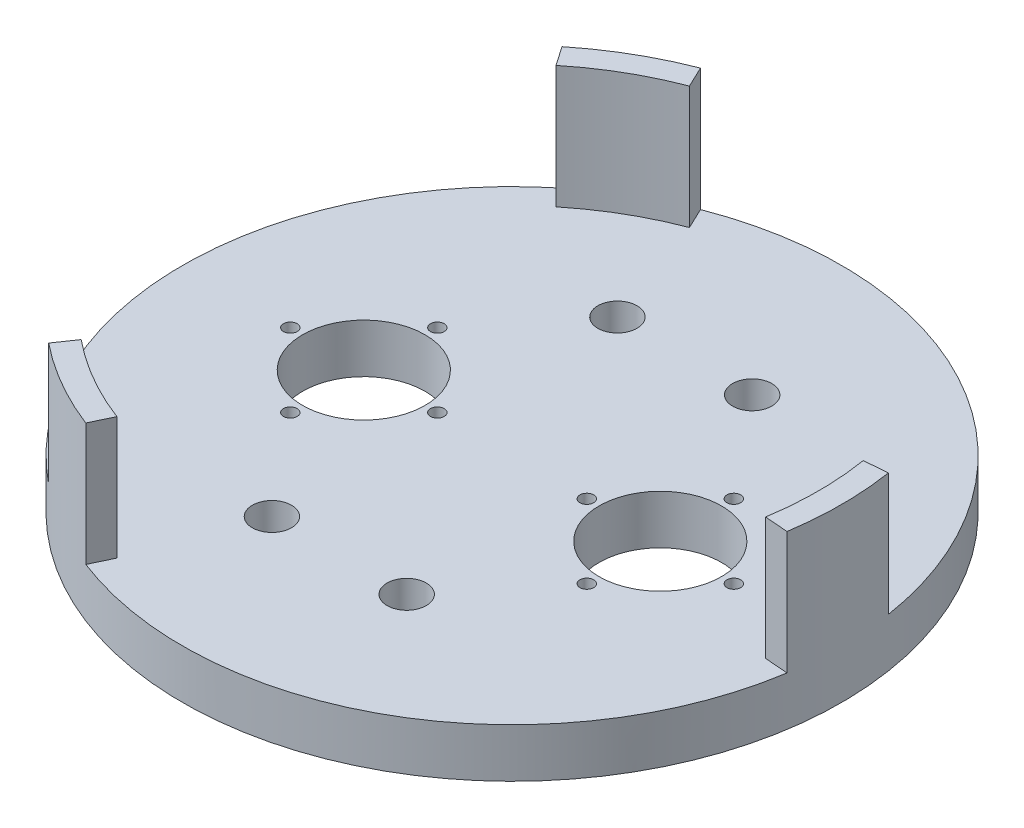
ISO-10303-21;
HEADER;
FILE_DESCRIPTION(('STEP AP214'),'2;1');
FILE_NAME('part.step','',(''),(''),'','','');
FILE_SCHEMA(('AUTOMOTIVE_DESIGN { 1 0 10303 214 1 1 1 1 }'));
ENDSEC;
DATA;
#1=APPLICATION_CONTEXT('core data for automotive mechanical design processes');
#2=APPLICATION_PROTOCOL_DEFINITION('international standard','automotive_design',2000,#1);
#3=PRODUCT_CONTEXT('',#1,'mechanical');
#4=PRODUCT('Part','Part','',(#3));
#5=PRODUCT_RELATED_PRODUCT_CATEGORY('part','',(#4));
#6=PRODUCT_DEFINITION_FORMATION('','',#4);
#7=PRODUCT_DEFINITION_CONTEXT('part definition',#1,'design');
#8=PRODUCT_DEFINITION('design','',#6,#7);
#9=PRODUCT_DEFINITION_SHAPE('','',#8);
#10=(LENGTH_UNIT() NAMED_UNIT(*) SI_UNIT(.MILLI.,.METRE.));
#11=(NAMED_UNIT(*) PLANE_ANGLE_UNIT() SI_UNIT($,.RADIAN.));
#12=(NAMED_UNIT(*) SI_UNIT($,.STERADIAN.) SOLID_ANGLE_UNIT());
#13=UNCERTAINTY_MEASURE_WITH_UNIT(LENGTH_MEASURE(1.E-05),#10,'distance_accuracy_value','');
#14=(GEOMETRIC_REPRESENTATION_CONTEXT(3) GLOBAL_UNCERTAINTY_ASSIGNED_CONTEXT((#13)) GLOBAL_UNIT_ASSIGNED_CONTEXT((#10,
#11,#12)) REPRESENTATION_CONTEXT('',''));
#15=CARTESIAN_POINT('',(0.,0.,0.));
#16=DIRECTION('',(0.,0.,1.));
#17=DIRECTION('',(1.,0.,0.));
#18=AXIS2_PLACEMENT_3D('',#15,#16,#17);
#19=CARTESIAN_POINT('',(63.8175,-154.94,-63.8175));
#20=DIRECTION('',(0.,1.,0.));
#21=DIRECTION('',(0.,0.,1.));
#22=AXIS2_PLACEMENT_3D('',#19,#20,#21);
#23=CYLINDRICAL_SURFACE('',#22,85.4075);
#24=CARTESIAN_POINT('',(63.8175,0.,-63.8175));
#25=DIRECTION('',(0.,-1.,0.));
#26=DIRECTION('',(0.,0.,-1.));
#27=AXIS2_PLACEMENT_3D('',#24,#25,#26);
#28=CIRCLE('',#27,85.4075);
#29=CARTESIAN_POINT('',(63.8175,0.,-149.225));
#30=VERTEX_POINT('',#29);
#31=EDGE_CURVE('E12',#30,#30,#28,.T.);
#32=ORIENTED_EDGE('',*,*,#31,.F.);
#33=EDGE_LOOP('',(#32));
#34=FACE_BOUND('',#33,.T.);
#35=CARTESIAN_POINT('',(63.8175,12.7,-63.8175));
#36=DIRECTION('',(0.,1.,0.));
#37=DIRECTION('',(0.,0.,1.));
#38=AXIS2_PLACEMENT_3D('',#35,#36,#37);
#39=CIRCLE('',#38,85.4075);
#40=CARTESIAN_POINT('',(10.2443081096491,12.7,2.69831892249124));
#41=VERTEX_POINT('',#40);
#42=CARTESIAN_POINT('',(10.2443081096491,12.7,-130.333318922491));
#43=VERTEX_POINT('',#42);
#44=EDGE_CURVE('E300',#41,#43,#39,.F.);
#45=ORIENTED_EDGE('',*,*,#44,.T.);
#46=DIRECTION('',(0.,1.,0.));
#47=VECTOR('',#46,1.);
#48=CARTESIAN_POINT('',(10.2443081096491,-154.94,-130.333318922491));
#49=LINE('',#48,#47);
#50=CARTESIAN_POINT('',(10.2443081096491,44.45,-130.333318922491));
#51=VERTEX_POINT('',#50);
#52=EDGE_CURVE('E143',#43,#51,#49,.T.);
#53=ORIENTED_EDGE('',*,*,#52,.T.);
#54=CARTESIAN_POINT('',(63.8175,44.45,-63.8175));
#55=DIRECTION('',(0.,1.,0.));
#56=DIRECTION('',(0.,0.,1.));
#57=AXIS2_PLACEMENT_3D('',#54,#55,#56);
#58=CIRCLE('',#57,85.4075);
#59=CARTESIAN_POINT('',(32.9997070047723,44.45,-143.471154600108));
#60=VERTEX_POINT('',#59);
#61=EDGE_CURVE('E172',#60,#51,#58,.T.);
#62=ORIENTED_EDGE('',*,*,#61,.F.);
#63=DIRECTION('',(0.,1.,0.));
#64=VECTOR('',#63,1.);
#65=CARTESIAN_POINT('',(32.9997070047723,-154.94,-143.471154600108));
#66=LINE('',#65,#64);
#67=CARTESIAN_POINT('',(32.9997070047723,12.7,-143.471154600108));
#68=VERTEX_POINT('',#67);
#69=EDGE_CURVE('E338',#68,#60,#66,.T.);
#70=ORIENTED_EDGE('',*,*,#69,.F.);
#71=CARTESIAN_POINT('',(63.8175,12.7,-63.8175));
#72=DIRECTION('',(0.,-1.,0.));
#73=DIRECTION('',(0.,0.,-1.));
#74=AXIS2_PLACEMENT_3D('',#71,#72,#73);
#75=CIRCLE('',#74,85.4075);
#76=CARTESIAN_POINT('',(148.208484885579,12.7,-76.9553356776167));
#77=VERTEX_POINT('',#76);
#78=EDGE_CURVE('E321',#77,#68,#75,.F.);
#79=ORIENTED_EDGE('',*,*,#78,.F.);
#80=DIRECTION('',(0.,1.,0.));
#81=VECTOR('',#80,1.);
#82=CARTESIAN_POINT('',(148.208484885579,-154.94,-76.9553356776167));
#83=LINE('',#82,#81);
#84=CARTESIAN_POINT('',(148.208484885579,44.45,-76.9553356776167));
#85=VERTEX_POINT('',#84);
#86=EDGE_CURVE('E344',#77,#85,#83,.T.);
#87=ORIENTED_EDGE('',*,*,#86,.T.);
#88=CARTESIAN_POINT('',(148.208484885579,44.45,-50.6796643223833));
#89=VERTEX_POINT('',#88);
#90=EDGE_CURVE('E167',#89,#85,#58,.T.);
#91=ORIENTED_EDGE('',*,*,#90,.F.);
#92=DIRECTION('',(0.,1.,0.));
#93=VECTOR('',#92,1.);
#94=CARTESIAN_POINT('',(148.208484885579,-154.94,-50.6796643223833));
#95=LINE('',#94,#93);
#96=CARTESIAN_POINT('',(148.208484885579,12.7,-50.6796643223833));
#97=VERTEX_POINT('',#96);
#98=EDGE_CURVE('E351',#97,#89,#95,.T.);
#99=ORIENTED_EDGE('',*,*,#98,.F.);
#100=CARTESIAN_POINT('',(63.8175,12.7,-63.8175));
#101=DIRECTION('',(0.,-1.,0.));
#102=DIRECTION('',(0.,0.,-1.));
#103=AXIS2_PLACEMENT_3D('',#100,#101,#102);
#104=CIRCLE('',#103,85.4075);
#105=CARTESIAN_POINT('',(32.9997070047724,12.7,15.836154600108));
#106=VERTEX_POINT('',#105);
#107=EDGE_CURVE('E324',#106,#97,#104,.F.);
#108=ORIENTED_EDGE('',*,*,#107,.F.);
#109=DIRECTION('',(0.,1.,0.));
#110=VECTOR('',#109,1.);
#111=CARTESIAN_POINT('',(32.9997070047724,-154.94,15.836154600108));
#112=LINE('',#111,#110);
#113=CARTESIAN_POINT('',(32.9997070047724,44.45,15.836154600108));
#114=VERTEX_POINT('',#113);
#115=EDGE_CURVE('E357',#106,#114,#112,.T.);
#116=ORIENTED_EDGE('',*,*,#115,.T.);
#117=CARTESIAN_POINT('',(10.2443081096491,44.45,2.69831892249126));
#118=VERTEX_POINT('',#117);
#119=EDGE_CURVE('E174',#118,#114,#58,.T.);
#120=ORIENTED_EDGE('',*,*,#119,.F.);
#121=DIRECTION('',(0.,1.,0.));
#122=VECTOR('',#121,1.);
#123=CARTESIAN_POINT('',(10.2443081096491,-154.94,2.69831892249126));
#124=LINE('',#123,#122);
#125=EDGE_CURVE('E332',#41,#118,#124,.T.);
#126=ORIENTED_EDGE('',*,*,#125,.F.);
#127=EDGE_LOOP('',(#45,#53,#62,#70,#79,#87,#91,#99,#108,#116,#120,#126));
#128=FACE_BOUND('',#127,.T.);
#129=ADVANCED_FACE('F47',(#34,#128),#23,.T.);
#130=CARTESIAN_POINT('',(63.8175,44.45,-63.8175));
#131=DIRECTION('',(0.,-1.,0.));
#132=DIRECTION('',(0.,0.,-1.));
#133=AXIS2_PLACEMENT_3D('',#130,#131,#132);
#134=CYLINDRICAL_SURFACE('',#133,79.375);
#135=CARTESIAN_POINT('',(63.8175,44.45,-63.8175));
#136=DIRECTION('',(0.,1.,0.));
#137=DIRECTION('',(0.,0.,1.));
#138=AXIS2_PLACEMENT_3D('',#135,#136,#137);
#139=CIRCLE('',#138,79.375);
#140=CARTESIAN_POINT('',(35.596435006904,44.45,-138.006192640155));
#141=VERTEX_POINT('',#140);
#142=CARTESIAN_POINT('',(13.6787399966178,44.45,-125.352005525951));
#143=VERTEX_POINT('',#142);
#144=EDGE_CURVE('E155',#141,#143,#139,.T.);
#145=ORIENTED_EDGE('',*,*,#144,.T.);
#146=DIRECTION('',(0.,-1.,0.));
#147=VECTOR('',#146,1.);
#148=CARTESIAN_POINT('',(13.6787399966178,124.300000066,-125.352005525951));
#149=LINE('',#148,#147);
#150=CARTESIAN_POINT('',(13.6787399966178,12.7,-125.352005525951));
#151=VERTEX_POINT('',#150);
#152=EDGE_CURVE('E140',#143,#151,#149,.T.);
#153=ORIENTED_EDGE('',*,*,#152,.T.);
#154=CARTESIAN_POINT('',(63.8175,12.7,-63.8175));
#155=DIRECTION('',(0.,-1.,0.));
#156=DIRECTION('',(0.,0.,-1.));
#157=AXIS2_PLACEMENT_3D('',#154,#155,#156);
#158=CIRCLE('',#157,79.375);
#159=CARTESIAN_POINT('',(35.596435006904,12.7,-138.006192640155));
#160=VERTEX_POINT('',#159);
#161=EDGE_CURVE('E51',#160,#151,#158,.F.);
#162=ORIENTED_EDGE('',*,*,#161,.F.);
#163=DIRECTION('',(0.,-1.,0.));
#164=VECTOR('',#163,1.);
#165=CARTESIAN_POINT('',(35.596435006904,124.300000066,-138.006192640155));
#166=LINE('',#165,#164);
#167=EDGE_CURVE('E366',#141,#160,#166,.T.);
#168=ORIENTED_EDGE('',*,*,#167,.F.);
#169=EDGE_LOOP('',(#145,#153,#162,#168));
#170=FACE_BOUND('',#169,.T.);
#171=ADVANCED_FACE('F152',(#170),#134,.F.);
#172=CARTESIAN_POINT('',(142.177324996478,44.45,-51.1633128857952));
#173=VERTEX_POINT('',#172);
#174=CARTESIAN_POINT('',(142.177324996478,44.45,-76.4716871142049));
#175=VERTEX_POINT('',#174);
#176=EDGE_CURVE('E184',#173,#175,#139,.T.);
#177=ORIENTED_EDGE('',*,*,#176,.T.);
#178=DIRECTION('',(0.,-1.,0.));
#179=VECTOR('',#178,1.);
#180=CARTESIAN_POINT('',(142.177324996478,124.300000066,-76.4716871142049));
#181=LINE('',#180,#179);
#182=CARTESIAN_POINT('',(142.177324996478,12.7,-76.4716871142049));
#183=VERTEX_POINT('',#182);
#184=EDGE_CURVE('E382',#175,#183,#181,.T.);
#185=ORIENTED_EDGE('',*,*,#184,.T.);
#186=CARTESIAN_POINT('',(142.177324996478,12.7,-51.1633128857952));
#187=VERTEX_POINT('',#186);
#188=EDGE_CURVE('E164',#187,#183,#158,.F.);
#189=ORIENTED_EDGE('',*,*,#188,.F.);
#190=DIRECTION('',(0.,-1.,0.));
#191=VECTOR('',#190,1.);
#192=CARTESIAN_POINT('',(142.177324996478,124.300000066,-51.1633128857952));
#193=LINE('',#192,#191);
#194=EDGE_CURVE('E374',#173,#187,#193,.T.);
#195=ORIENTED_EDGE('',*,*,#194,.F.);
#196=EDGE_LOOP('',(#177,#185,#189,#195));
#197=FACE_BOUND('',#196,.T.);
#198=ADVANCED_FACE('F412',(#197),#134,.F.);
#199=CARTESIAN_POINT('',(63.8175,44.45,-63.8175));
#200=DIRECTION('',(0.,1.,0.));
#201=DIRECTION('',(0.,0.,1.));
#202=AXIS2_PLACEMENT_3D('',#199,#200,#201);
#203=PLANE('',#202);
#204=ORIENTED_EDGE('',*,*,#61,.T.);
#205=DIRECTION('',(0.567625801500095,0.,0.82328667514504));
#206=VECTOR('',#205,1.);
#207=CARTESIAN_POINT('',(58.5896296128291,44.45,-60.2130761604744));
#208=LINE('',#207,#206);
#209=EDGE_CURVE('E329',#51,#143,#208,.T.);
#210=ORIENTED_EDGE('',*,*,#209,.T.);
#211=ORIENTED_EDGE('',*,*,#144,.F.);
#212=DIRECTION('',(0.429174274522788,0.,0.903221701515104));
#213=VECTOR('',#212,1.);
#214=CARTESIAN_POINT('',(69.5529578046211,44.45,-66.5427566432198));
#215=LINE('',#214,#213);
#216=EDGE_CURVE('E341',#60,#141,#215,.T.);
#217=ORIENTED_EDGE('',*,*,#216,.F.);
#218=EDGE_LOOP('',(#204,#210,#211,#217));
#219=FACE_BOUND('',#218,.T.);
#220=ADVANCED_FACE('F403',(#219),#203,.T.);
#221=ORIENTED_EDGE('',*,*,#90,.T.);
#222=DIRECTION('',(-0.996800076022879,0.,0.0799350263700611));
#223=VECTOR('',#222,1.);
#224=CARTESIAN_POINT('',(63.3099125825501,44.45,-70.1471804827456));
#225=LINE('',#224,#223);
#226=EDGE_CURVE('E348',#85,#175,#225,.T.);
#227=ORIENTED_EDGE('',*,*,#226,.T.);
#228=ORIENTED_EDGE('',*,*,#176,.F.);
#229=DIRECTION('',(-0.996800076022879,0.,-0.0799350263700605));
#230=VECTOR('',#229,1.);
#231=CARTESIAN_POINT('',(63.3099125825501,44.45,-57.4878195172544));
#232=LINE('',#231,#230);
#233=EDGE_CURVE('E354',#89,#173,#232,.T.);
#234=ORIENTED_EDGE('',*,*,#233,.F.);
#235=EDGE_LOOP('',(#221,#227,#228,#234));
#236=FACE_BOUND('',#235,.T.);
#237=ADVANCED_FACE('F404',(#236),#203,.T.);
#238=CARTESIAN_POINT('',(0.,0.,0.));
#239=DIRECTION('',(0.,-1.,0.));
#240=DIRECTION('',(0.,0.,-1.));
#241=AXIS2_PLACEMENT_3D('',#238,#239,#240);
#242=PLANE('',#241);
#243=CARTESIAN_POINT('',(46.355,0.,-19.05));
#244=DIRECTION('',(0.,1.,0.));
#245=DIRECTION('',(0.,0.,-1.));
#246=AXIS2_PLACEMENT_3D('',#243,#244,#245);
#247=CIRCLE('',#246,5.08);
#248=CARTESIAN_POINT('',(46.355,0.,-24.13));
#249=VERTEX_POINT('',#248);
#250=EDGE_CURVE('E299',#249,#249,#247,.T.);
#251=ORIENTED_EDGE('',*,*,#250,.T.);
#252=EDGE_LOOP('',(#251));
#253=FACE_BOUND('',#252,.T.);
#254=CARTESIAN_POINT('',(81.28,0.,-19.05));
#255=DIRECTION('',(0.,1.,0.));
#256=DIRECTION('',(0.,0.,1.));
#257=AXIS2_PLACEMENT_3D('',#254,#255,#256);
#258=CIRCLE('',#257,5.08);
#259=CARTESIAN_POINT('',(81.28,0.,-13.97));
#260=VERTEX_POINT('',#259);
#261=EDGE_CURVE('E308',#260,#260,#258,.T.);
#262=ORIENTED_EDGE('',*,*,#261,.T.);
#263=EDGE_LOOP('',(#262));
#264=FACE_BOUND('',#263,.T.);
#265=CARTESIAN_POINT('',(81.28,0.,-108.585));
#266=DIRECTION('',(0.,1.,0.));
#267=DIRECTION('',(0.,0.,-1.));
#268=AXIS2_PLACEMENT_3D('',#265,#266,#267);
#269=CIRCLE('',#268,5.08000000000001);
#270=CARTESIAN_POINT('',(81.28,0.,-113.665));
#271=VERTEX_POINT('',#270);
#272=EDGE_CURVE('E291',#271,#271,#269,.T.);
#273=ORIENTED_EDGE('',*,*,#272,.T.);
#274=EDGE_LOOP('',(#273));
#275=FACE_BOUND('',#274,.T.);
#276=CARTESIAN_POINT('',(46.355,0.,-108.585));
#277=DIRECTION('',(0.,1.,0.));
#278=DIRECTION('',(0.,0.,1.));
#279=AXIS2_PLACEMENT_3D('',#276,#277,#278);
#280=CIRCLE('',#279,5.08);
#281=CARTESIAN_POINT('',(46.355,0.,-103.505));
#282=VERTEX_POINT('',#281);
#283=EDGE_CURVE('E283',#282,#282,#280,.T.);
#284=ORIENTED_EDGE('',*,*,#283,.T.);
#285=EDGE_LOOP('',(#284));
#286=FACE_BOUND('',#285,.T.);
#287=CARTESIAN_POINT('',(83.1850000000002,0.,-63.8174999999999));
#288=DIRECTION('',(0.,1.,0.));
#289=DIRECTION('',(0.,0.,1.));
#290=AXIS2_PLACEMENT_3D('',#287,#288,#289);
#291=CIRCLE('',#290,1.778);
#292=CARTESIAN_POINT('',(83.1850000000002,0.,-62.0394999999999));
#293=VERTEX_POINT('',#292);
#294=EDGE_CURVE('E236',#293,#293,#291,.T.);
#295=ORIENTED_EDGE('',*,*,#294,.T.);
#296=EDGE_LOOP('',(#295));
#297=FACE_BOUND('',#296,.T.);
#298=CARTESIAN_POINT('',(25.4,0.,-82.8675));
#299=DIRECTION('',(0.,1.,0.));
#300=DIRECTION('',(0.,0.,-1.));
#301=AXIS2_PLACEMENT_3D('',#298,#299,#300);
#302=CIRCLE('',#301,1.778);
#303=CARTESIAN_POINT('',(25.4,0.,-84.6455));
#304=VERTEX_POINT('',#303);
#305=EDGE_CURVE('E251',#304,#304,#302,.T.);
#306=ORIENTED_EDGE('',*,*,#305,.T.);
#307=EDGE_LOOP('',(#306));
#308=FACE_BOUND('',#307,.T.);
#309=CARTESIAN_POINT('',(6.34999999999974,0.,-63.8175000000002));
#310=DIRECTION('',(0.,1.,0.));
#311=DIRECTION('',(0.,0.,-1.));
#312=AXIS2_PLACEMENT_3D('',#309,#310,#311);
#313=CIRCLE('',#312,1.778);
#314=CARTESIAN_POINT('',(6.34999999999974,0.,-65.5955000000002));
#315=VERTEX_POINT('',#314);
#316=EDGE_CURVE('E252',#315,#315,#313,.T.);
#317=ORIENTED_EDGE('',*,*,#316,.T.);
#318=EDGE_LOOP('',(#317));
#319=FACE_BOUND('',#318,.T.);
#320=CARTESIAN_POINT('',(25.3999999999996,0.,-44.7675));
#321=DIRECTION('',(0.,1.,0.));
#322=DIRECTION('',(0.,0.,-1.));
#323=AXIS2_PLACEMENT_3D('',#320,#321,#322);
#324=CIRCLE('',#323,1.778);
#325=CARTESIAN_POINT('',(25.3999999999996,0.,-46.5455));
#326=VERTEX_POINT('',#325);
#327=EDGE_CURVE('E267',#326,#326,#324,.T.);
#328=ORIENTED_EDGE('',*,*,#327,.T.);
#329=EDGE_LOOP('',(#328));
#330=FACE_BOUND('',#329,.T.);
#331=CARTESIAN_POINT('',(102.235,0.,-82.8675));
#332=DIRECTION('',(0.,1.,0.));
#333=DIRECTION('',(0.,0.,1.));
#334=AXIS2_PLACEMENT_3D('',#331,#332,#333);
#335=CIRCLE('',#334,1.778);
#336=CARTESIAN_POINT('',(102.235,0.,-81.0895));
#337=VERTEX_POINT('',#336);
#338=EDGE_CURVE('E213',#337,#337,#335,.T.);
#339=ORIENTED_EDGE('',*,*,#338,.T.);
#340=EDGE_LOOP('',(#339));
#341=FACE_BOUND('',#340,.T.);
#342=CARTESIAN_POINT('',(25.4,0.,-63.8175));
#343=DIRECTION('',(0.,1.,0.));
#344=DIRECTION('',(0.,0.,-1.));
#345=AXIS2_PLACEMENT_3D('',#342,#343,#344);
#346=CIRCLE('',#345,15.875);
#347=CARTESIAN_POINT('',(25.4,0.,-79.6925));
#348=VERTEX_POINT('',#347);
#349=EDGE_CURVE('E219',#348,#348,#346,.T.);
#350=ORIENTED_EDGE('',*,*,#349,.T.);
#351=EDGE_LOOP('',(#350));
#352=FACE_BOUND('',#351,.T.);
#353=CARTESIAN_POINT('',(121.285,0.,-63.8175000000002));
#354=DIRECTION('',(0.,1.,0.));
#355=DIRECTION('',(0.,0.,1.));
#356=AXIS2_PLACEMENT_3D('',#353,#354,#355);
#357=CIRCLE('',#356,1.778);
#358=CARTESIAN_POINT('',(121.285,0.,-62.0395000000002));
#359=VERTEX_POINT('',#358);
#360=EDGE_CURVE('E220',#359,#359,#357,.T.);
#361=ORIENTED_EDGE('',*,*,#360,.T.);
#362=EDGE_LOOP('',(#361));
#363=FACE_BOUND('',#362,.T.);
#364=CARTESIAN_POINT('',(102.235,0.,-44.7675));
#365=DIRECTION('',(0.,1.,0.));
#366=DIRECTION('',(0.,0.,1.));
#367=AXIS2_PLACEMENT_3D('',#364,#365,#366);
#368=CIRCLE('',#367,1.778);
#369=CARTESIAN_POINT('',(102.235,0.,-42.9895));
#370=VERTEX_POINT('',#369);
#371=EDGE_CURVE('E235',#370,#370,#368,.T.);
#372=ORIENTED_EDGE('',*,*,#371,.T.);
#373=EDGE_LOOP('',(#372));
#374=FACE_BOUND('',#373,.T.);
#375=CARTESIAN_POINT('',(44.4499999999998,0.,-63.8174999999999));
#376=DIRECTION('',(0.,1.,0.));
#377=DIRECTION('',(0.,0.,-1.));
#378=AXIS2_PLACEMENT_3D('',#375,#376,#377);
#379=CIRCLE('',#378,1.778);
#380=CARTESIAN_POINT('',(44.4499999999998,0.,-65.5954999999999));
#381=VERTEX_POINT('',#380);
#382=EDGE_CURVE('E268',#381,#381,#379,.T.);
#383=ORIENTED_EDGE('',*,*,#382,.T.);
#384=EDGE_LOOP('',(#383));
#385=FACE_BOUND('',#384,.T.);
#386=CARTESIAN_POINT('',(102.235,0.,-63.8175));
#387=DIRECTION('',(0.,1.,0.));
#388=DIRECTION('',(0.,0.,1.));
#389=AXIS2_PLACEMENT_3D('',#386,#387,#388);
#390=CIRCLE('',#389,15.875);
#391=CARTESIAN_POINT('',(102.235,0.,-47.9425));
#392=VERTEX_POINT('',#391);
#393=EDGE_CURVE('E200',#392,#392,#390,.T.);
#394=ORIENTED_EDGE('',*,*,#393,.T.);
#395=EDGE_LOOP('',(#394));
#396=FACE_BOUND('',#395,.T.);
#397=ORIENTED_EDGE('',*,*,#31,.T.);
#398=EDGE_LOOP('',(#397));
#399=FACE_BOUND('',#398,.T.);
#400=ADVANCED_FACE('F49',(#253,#264,#275,#286,#297,#308,#319,#330,#341,#352,#363,#374,#385,#396,
#399),#242,.T.);
#401=DIRECTION('',(0.,-1.,0.));
#402=VECTOR('',#401,1.);
#403=CARTESIAN_POINT('',(13.6787399966178,124.300000066,-2.28299447404944));
#404=LINE('',#403,#402);
#405=CARTESIAN_POINT('',(13.6787399966178,44.45,-2.28299447404944));
#406=VERTEX_POINT('',#405);
#407=CARTESIAN_POINT('',(13.6787399966178,12.7,-2.28299447404944));
#408=VERTEX_POINT('',#407);
#409=EDGE_CURVE('E157',#406,#408,#404,.T.);
#410=ORIENTED_EDGE('',*,*,#409,.F.);
#411=CARTESIAN_POINT('',(35.596435006904,44.45,10.3711926401555));
#412=VERTEX_POINT('',#411);
#413=EDGE_CURVE('E191',#406,#412,#139,.T.);
#414=ORIENTED_EDGE('',*,*,#413,.T.);
#415=DIRECTION('',(0.,-1.,0.));
#416=VECTOR('',#415,1.);
#417=CARTESIAN_POINT('',(35.596435006904,124.300000066,10.3711926401555));
#418=LINE('',#417,#416);
#419=CARTESIAN_POINT('',(35.596435006904,12.7,10.3711926401555));
#420=VERTEX_POINT('',#419);
#421=EDGE_CURVE('E371',#412,#420,#418,.T.);
#422=ORIENTED_EDGE('',*,*,#421,.T.);
#423=EDGE_CURVE('E163',#408,#420,#158,.F.);
#424=ORIENTED_EDGE('',*,*,#423,.F.);
#425=EDGE_LOOP('',(#410,#414,#422,#424));
#426=FACE_BOUND('',#425,.T.);
#427=ADVANCED_FACE('F399',(#426),#134,.F.);
#428=DIRECTION('',(0.567625801500091,0.,-0.823286675145043));
#429=VECTOR('',#428,1.);
#430=CARTESIAN_POINT('',(58.5896296128287,44.45,-67.4219238395257));
#431=LINE('',#430,#429);
#432=EDGE_CURVE('E335',#118,#406,#431,.T.);
#433=ORIENTED_EDGE('',*,*,#432,.F.);
#434=ORIENTED_EDGE('',*,*,#119,.T.);
#435=DIRECTION('',(0.429174274522788,0.,-0.903221701515104));
#436=VECTOR('',#435,1.);
#437=CARTESIAN_POINT('',(69.5529578046212,44.45,-61.0922433567802));
#438=LINE('',#437,#436);
#439=EDGE_CURVE('E361',#114,#412,#438,.T.);
#440=ORIENTED_EDGE('',*,*,#439,.T.);
#441=ORIENTED_EDGE('',*,*,#413,.F.);
#442=EDGE_LOOP('',(#433,#434,#440,#441));
#443=FACE_BOUND('',#442,.T.);
#444=ADVANCED_FACE('F400',(#443),#203,.T.);
#445=CARTESIAN_POINT('',(0.,12.7,0.));
#446=DIRECTION('',(0.,-1.,0.));
#447=DIRECTION('',(0.,0.,-1.));
#448=AXIS2_PLACEMENT_3D('',#445,#446,#447);
#449=PLANE('',#448);
#450=CARTESIAN_POINT('',(46.355,12.7,-19.05));
#451=DIRECTION('',(0.,1.,0.));
#452=DIRECTION('',(0.,0.,-1.));
#453=AXIS2_PLACEMENT_3D('',#450,#451,#452);
#454=CIRCLE('',#453,5.08);
#455=CARTESIAN_POINT('',(46.355,12.7,-24.13));
#456=VERTEX_POINT('',#455);
#457=EDGE_CURVE('E295',#456,#456,#454,.T.);
#458=ORIENTED_EDGE('',*,*,#457,.F.);
#459=EDGE_LOOP('',(#458));
#460=FACE_BOUND('',#459,.T.);
#461=CARTESIAN_POINT('',(81.28,12.7,-19.05));
#462=DIRECTION('',(0.,1.,0.));
#463=DIRECTION('',(0.,0.,1.));
#464=AXIS2_PLACEMENT_3D('',#461,#462,#463);
#465=CIRCLE('',#464,5.08);
#466=CARTESIAN_POINT('',(81.28,12.7,-13.97));
#467=VERTEX_POINT('',#466);
#468=EDGE_CURVE('E304',#467,#467,#465,.T.);
#469=ORIENTED_EDGE('',*,*,#468,.F.);
#470=EDGE_LOOP('',(#469));
#471=FACE_BOUND('',#470,.T.);
#472=CARTESIAN_POINT('',(81.28,12.7,-108.585));
#473=DIRECTION('',(0.,1.,0.));
#474=DIRECTION('',(0.,0.,-1.));
#475=AXIS2_PLACEMENT_3D('',#472,#473,#474);
#476=CIRCLE('',#475,5.08000000000001);
#477=CARTESIAN_POINT('',(81.28,12.7,-113.665));
#478=VERTEX_POINT('',#477);
#479=EDGE_CURVE('E312',#478,#478,#476,.T.);
#480=ORIENTED_EDGE('',*,*,#479,.F.);
#481=EDGE_LOOP('',(#480));
#482=FACE_BOUND('',#481,.T.);
#483=CARTESIAN_POINT('',(46.355,12.7,-108.585));
#484=DIRECTION('',(0.,1.,0.));
#485=DIRECTION('',(0.,0.,1.));
#486=AXIS2_PLACEMENT_3D('',#483,#484,#485);
#487=CIRCLE('',#486,5.08);
#488=CARTESIAN_POINT('',(46.355,12.7,-103.505));
#489=VERTEX_POINT('',#488);
#490=EDGE_CURVE('E287',#489,#489,#487,.T.);
#491=ORIENTED_EDGE('',*,*,#490,.F.);
#492=EDGE_LOOP('',(#491));
#493=FACE_BOUND('',#492,.T.);
#494=CARTESIAN_POINT('',(83.1850000000002,12.7,-63.8174999999999));
#495=DIRECTION('',(0.,1.,0.));
#496=DIRECTION('',(0.,0.,1.));
#497=AXIS2_PLACEMENT_3D('',#494,#495,#496);
#498=CIRCLE('',#497,1.778);
#499=CARTESIAN_POINT('',(83.1850000000002,12.7,-62.0394999999999));
#500=VERTEX_POINT('',#499);
#501=EDGE_CURVE('E256',#500,#500,#498,.T.);
#502=ORIENTED_EDGE('',*,*,#501,.F.);
#503=EDGE_LOOP('',(#502));
#504=FACE_BOUND('',#503,.T.);
#505=CARTESIAN_POINT('',(25.4,12.7,-82.8675));
#506=DIRECTION('',(0.,1.,0.));
#507=DIRECTION('',(0.,0.,-1.));
#508=AXIS2_PLACEMENT_3D('',#505,#506,#507);
#509=CIRCLE('',#508,1.778);
#510=CARTESIAN_POINT('',(25.4,12.7,-84.6455));
#511=VERTEX_POINT('',#510);
#512=EDGE_CURVE('E247',#511,#511,#509,.T.);
#513=ORIENTED_EDGE('',*,*,#512,.F.);
#514=EDGE_LOOP('',(#513));
#515=FACE_BOUND('',#514,.T.);
#516=CARTESIAN_POINT('',(6.34999999999974,12.7,-63.8175000000002));
#517=DIRECTION('',(0.,1.,0.));
#518=DIRECTION('',(0.,0.,-1.));
#519=AXIS2_PLACEMENT_3D('',#516,#517,#518);
#520=CIRCLE('',#519,1.778);
#521=CARTESIAN_POINT('',(6.34999999999974,12.7,-65.5955000000002));
#522=VERTEX_POINT('',#521);
#523=EDGE_CURVE('E272',#522,#522,#520,.T.);
#524=ORIENTED_EDGE('',*,*,#523,.F.);
#525=EDGE_LOOP('',(#524));
#526=FACE_BOUND('',#525,.T.);
#527=CARTESIAN_POINT('',(25.3999999999996,12.7,-44.7675));
#528=DIRECTION('',(0.,1.,0.));
#529=DIRECTION('',(0.,0.,-1.));
#530=AXIS2_PLACEMENT_3D('',#527,#528,#529);
#531=CIRCLE('',#530,1.778);
#532=CARTESIAN_POINT('',(25.3999999999996,12.7,-46.5455));
#533=VERTEX_POINT('',#532);
#534=EDGE_CURVE('E263',#533,#533,#531,.T.);
#535=ORIENTED_EDGE('',*,*,#534,.F.);
#536=EDGE_LOOP('',(#535));
#537=FACE_BOUND('',#536,.T.);
#538=CARTESIAN_POINT('',(102.235,12.7,-82.8675));
#539=DIRECTION('',(0.,1.,0.));
#540=DIRECTION('',(0.,0.,1.));
#541=AXIS2_PLACEMENT_3D('',#538,#539,#540);
#542=CIRCLE('',#541,1.778);
#543=CARTESIAN_POINT('',(102.235,12.7,-81.0895));
#544=VERTEX_POINT('',#543);
#545=EDGE_CURVE('E224',#544,#544,#542,.T.);
#546=ORIENTED_EDGE('',*,*,#545,.F.);
#547=EDGE_LOOP('',(#546));
#548=FACE_BOUND('',#547,.T.);
#549=CARTESIAN_POINT('',(25.4,12.7,-63.8175));
#550=DIRECTION('',(0.,1.,0.));
#551=DIRECTION('',(0.,0.,-1.));
#552=AXIS2_PLACEMENT_3D('',#549,#550,#551);
#553=CIRCLE('',#552,15.875);
#554=CARTESIAN_POINT('',(25.4,12.7,-79.6925));
#555=VERTEX_POINT('',#554);
#556=EDGE_CURVE('E215',#555,#555,#553,.T.);
#557=ORIENTED_EDGE('',*,*,#556,.F.);
#558=EDGE_LOOP('',(#557));
#559=FACE_BOUND('',#558,.T.);
#560=CARTESIAN_POINT('',(121.285,12.7,-63.8175000000002));
#561=DIRECTION('',(0.,1.,0.));
#562=DIRECTION('',(0.,0.,1.));
#563=AXIS2_PLACEMENT_3D('',#560,#561,#562);
#564=CIRCLE('',#563,1.778);
#565=CARTESIAN_POINT('',(121.285,12.7,-62.0395000000002));
#566=VERTEX_POINT('',#565);
#567=EDGE_CURVE('E240',#566,#566,#564,.T.);
#568=ORIENTED_EDGE('',*,*,#567,.F.);
#569=EDGE_LOOP('',(#568));
#570=FACE_BOUND('',#569,.T.);
#571=CARTESIAN_POINT('',(102.235,12.7,-44.7675));
#572=DIRECTION('',(0.,1.,0.));
#573=DIRECTION('',(0.,0.,1.));
#574=AXIS2_PLACEMENT_3D('',#571,#572,#573);
#575=CIRCLE('',#574,1.778);
#576=CARTESIAN_POINT('',(102.235,12.7,-42.9895));
#577=VERTEX_POINT('',#576);
#578=EDGE_CURVE('E231',#577,#577,#575,.T.);
#579=ORIENTED_EDGE('',*,*,#578,.F.);
#580=EDGE_LOOP('',(#579));
#581=FACE_BOUND('',#580,.T.);
#582=CARTESIAN_POINT('',(44.4499999999998,12.7,-63.8174999999999));
#583=DIRECTION('',(0.,1.,0.));
#584=DIRECTION('',(0.,0.,-1.));
#585=AXIS2_PLACEMENT_3D('',#582,#583,#584);
#586=CIRCLE('',#585,1.778);
#587=CARTESIAN_POINT('',(44.4499999999998,12.7,-65.5954999999999));
#588=VERTEX_POINT('',#587);
#589=EDGE_CURVE('E279',#588,#588,#586,.T.);
#590=ORIENTED_EDGE('',*,*,#589,.F.);
#591=EDGE_LOOP('',(#590));
#592=FACE_BOUND('',#591,.T.);
#593=CARTESIAN_POINT('',(102.235,12.7,-63.8175));
#594=DIRECTION('',(0.,1.,0.));
#595=DIRECTION('',(0.,0.,1.));
#596=AXIS2_PLACEMENT_3D('',#593,#594,#595);
#597=CIRCLE('',#596,15.875);
#598=CARTESIAN_POINT('',(102.235,12.7,-47.9425));
#599=VERTEX_POINT('',#598);
#600=EDGE_CURVE('E207',#599,#599,#597,.T.);
#601=ORIENTED_EDGE('',*,*,#600,.F.);
#602=EDGE_LOOP('',(#601));
#603=FACE_BOUND('',#602,.T.);
#604=ORIENTED_EDGE('',*,*,#161,.T.);
#605=DIRECTION('',(-0.567625801500095,0.,-0.82328667514504));
#606=VECTOR('',#605,1.);
#607=CARTESIAN_POINT('',(67.8508065982169,12.7,-46.7806289600833));
#608=LINE('',#607,#606);
#609=EDGE_CURVE('E137',#151,#43,#608,.T.);
#610=ORIENTED_EDGE('',*,*,#609,.T.);
#611=ORIENTED_EDGE('',*,*,#44,.F.);
#612=DIRECTION('',(-0.567625801500091,0.,0.823286675145043));
#613=VECTOR('',#612,1.);
#614=CARTESIAN_POINT('',(8.2045768132202,12.7,5.65675314586224));
#615=LINE('',#614,#613);
#616=EDGE_CURVE('E70',#408,#41,#615,.T.);
#617=ORIENTED_EDGE('',*,*,#616,.F.);
#618=ORIENTED_EDGE('',*,*,#423,.T.);
#619=DIRECTION('',(-0.429174274522788,0.,0.903221701515104));
#620=VECTOR('',#619,1.);
#621=CARTESIAN_POINT('',(35.596435006904,12.7,10.3711926401554));
#622=LINE('',#621,#620);
#623=EDGE_CURVE('E367',#420,#106,#622,.T.);
#624=ORIENTED_EDGE('',*,*,#623,.T.);
#625=ORIENTED_EDGE('',*,*,#107,.T.);
#626=DIRECTION('',(0.996800076022879,0.,0.0799350263700605));
#627=VECTOR('',#626,1.);
#628=CARTESIAN_POINT('',(142.177324996478,12.7,-51.1633128857952));
#629=LINE('',#628,#627);
#630=EDGE_CURVE('E63',#187,#97,#629,.T.);
#631=ORIENTED_EDGE('',*,*,#630,.F.);
#632=ORIENTED_EDGE('',*,*,#188,.T.);
#633=DIRECTION('',(0.996800076022879,0.,-0.0799350263700611));
#634=VECTOR('',#633,1.);
#635=CARTESIAN_POINT('',(142.177324996478,12.7,-76.4716871142049));
#636=LINE('',#635,#634);
#637=EDGE_CURVE('E379',#183,#77,#636,.T.);
#638=ORIENTED_EDGE('',*,*,#637,.T.);
#639=ORIENTED_EDGE('',*,*,#78,.T.);
#640=DIRECTION('',(-0.429174274522788,0.,-0.903221701515104));
#641=VECTOR('',#640,1.);
#642=CARTESIAN_POINT('',(35.596435006904,12.7,-138.006192640155));
#643=LINE('',#642,#641);
#644=EDGE_CURVE('E147',#160,#68,#643,.T.);
#645=ORIENTED_EDGE('',*,*,#644,.F.);
#646=EDGE_LOOP('',(#604,#610,#611,#617,#618,#624,#625,#631,#632,#638,#639,#645));
#647=FACE_BOUND('',#646,.T.);
#648=ADVANCED_FACE('F159',(#460,#471,#482,#493,#504,#515,#526,#537,#548,#559,#570,#581,#592,
#603,#647),#449,.F.);
#649=CARTESIAN_POINT('',(102.235,0.,-63.8175));
#650=DIRECTION('',(0.,1.,0.));
#651=DIRECTION('',(0.,0.,1.));
#652=AXIS2_PLACEMENT_3D('',#649,#650,#651);
#653=CYLINDRICAL_SURFACE('',#652,15.875);
#654=ORIENTED_EDGE('',*,*,#393,.F.);
#655=EDGE_LOOP('',(#654));
#656=FACE_BOUND('',#655,.T.);
#657=ORIENTED_EDGE('',*,*,#600,.T.);
#658=EDGE_LOOP('',(#657));
#659=FACE_BOUND('',#658,.T.);
#660=ADVANCED_FACE('F409',(#656,#659),#653,.F.);
#661=CARTESIAN_POINT('',(44.4499999999998,0.,-63.8174999999999));
#662=DIRECTION('',(0.,1.,0.));
#663=DIRECTION('',(0.,0.,1.));
#664=AXIS2_PLACEMENT_3D('',#661,#662,#663);
#665=CYLINDRICAL_SURFACE('',#664,1.778);
#666=ORIENTED_EDGE('',*,*,#382,.F.);
#667=EDGE_LOOP('',(#666));
#668=FACE_BOUND('',#667,.T.);
#669=ORIENTED_EDGE('',*,*,#589,.T.);
#670=EDGE_LOOP('',(#669));
#671=FACE_BOUND('',#670,.T.);
#672=ADVANCED_FACE('F454',(#668,#671),#665,.F.);
#673=CARTESIAN_POINT('',(102.235,0.,-44.7675));
#674=DIRECTION('',(0.,1.,0.));
#675=DIRECTION('',(0.,0.,1.));
#676=AXIS2_PLACEMENT_3D('',#673,#674,#675);
#677=CYLINDRICAL_SURFACE('',#676,1.778);
#678=ORIENTED_EDGE('',*,*,#371,.F.);
#679=EDGE_LOOP('',(#678));
#680=FACE_BOUND('',#679,.T.);
#681=ORIENTED_EDGE('',*,*,#578,.T.);
#682=EDGE_LOOP('',(#681));
#683=FACE_BOUND('',#682,.T.);
#684=ADVANCED_FACE('F457',(#680,#683),#677,.F.);
#685=CARTESIAN_POINT('',(121.285,0.,-63.8175000000002));
#686=DIRECTION('',(0.,1.,0.));
#687=DIRECTION('',(0.,0.,1.));
#688=AXIS2_PLACEMENT_3D('',#685,#686,#687);
#689=CYLINDRICAL_SURFACE('',#688,1.778);
#690=ORIENTED_EDGE('',*,*,#360,.F.);
#691=EDGE_LOOP('',(#690));
#692=FACE_BOUND('',#691,.T.);
#693=ORIENTED_EDGE('',*,*,#567,.T.);
#694=EDGE_LOOP('',(#693));
#695=FACE_BOUND('',#694,.T.);
#696=ADVANCED_FACE('F474',(#692,#695),#689,.F.);
#697=CARTESIAN_POINT('',(25.4,0.,-63.8175));
#698=DIRECTION('',(0.,1.,0.));
#699=DIRECTION('',(0.,0.,1.));
#700=AXIS2_PLACEMENT_3D('',#697,#698,#699);
#701=CYLINDRICAL_SURFACE('',#700,15.875);
#702=ORIENTED_EDGE('',*,*,#349,.F.);
#703=EDGE_LOOP('',(#702));
#704=FACE_BOUND('',#703,.T.);
#705=ORIENTED_EDGE('',*,*,#556,.T.);
#706=EDGE_LOOP('',(#705));
#707=FACE_BOUND('',#706,.T.);
#708=ADVANCED_FACE('F470',(#704,#707),#701,.F.);
#709=CARTESIAN_POINT('',(102.235,0.,-82.8675));
#710=DIRECTION('',(0.,1.,0.));
#711=DIRECTION('',(0.,0.,1.));
#712=AXIS2_PLACEMENT_3D('',#709,#710,#711);
#713=CYLINDRICAL_SURFACE('',#712,1.778);
#714=ORIENTED_EDGE('',*,*,#338,.F.);
#715=EDGE_LOOP('',(#714));
#716=FACE_BOUND('',#715,.T.);
#717=ORIENTED_EDGE('',*,*,#545,.T.);
#718=EDGE_LOOP('',(#717));
#719=FACE_BOUND('',#718,.T.);
#720=ADVANCED_FACE('F473',(#716,#719),#713,.F.);
#721=CARTESIAN_POINT('',(25.3999999999996,0.,-44.7675));
#722=DIRECTION('',(0.,1.,0.));
#723=DIRECTION('',(0.,0.,1.));
#724=AXIS2_PLACEMENT_3D('',#721,#722,#723);
#725=CYLINDRICAL_SURFACE('',#724,1.778);
#726=ORIENTED_EDGE('',*,*,#327,.F.);
#727=EDGE_LOOP('',(#726));
#728=FACE_BOUND('',#727,.T.);
#729=ORIENTED_EDGE('',*,*,#534,.T.);
#730=EDGE_LOOP('',(#729));
#731=FACE_BOUND('',#730,.T.);
#732=ADVANCED_FACE('F478',(#728,#731),#725,.F.);
#733=CARTESIAN_POINT('',(6.34999999999974,0.,-63.8175000000002));
#734=DIRECTION('',(0.,1.,0.));
#735=DIRECTION('',(0.,0.,1.));
#736=AXIS2_PLACEMENT_3D('',#733,#734,#735);
#737=CYLINDRICAL_SURFACE('',#736,1.778);
#738=ORIENTED_EDGE('',*,*,#316,.F.);
#739=EDGE_LOOP('',(#738));
#740=FACE_BOUND('',#739,.T.);
#741=ORIENTED_EDGE('',*,*,#523,.T.);
#742=EDGE_LOOP('',(#741));
#743=FACE_BOUND('',#742,.T.);
#744=ADVANCED_FACE('F490',(#740,#743),#737,.F.);
#745=CARTESIAN_POINT('',(25.4,0.,-82.8675));
#746=DIRECTION('',(0.,1.,0.));
#747=DIRECTION('',(0.,0.,1.));
#748=AXIS2_PLACEMENT_3D('',#745,#746,#747);
#749=CYLINDRICAL_SURFACE('',#748,1.778);
#750=ORIENTED_EDGE('',*,*,#305,.F.);
#751=EDGE_LOOP('',(#750));
#752=FACE_BOUND('',#751,.T.);
#753=ORIENTED_EDGE('',*,*,#512,.T.);
#754=EDGE_LOOP('',(#753));
#755=FACE_BOUND('',#754,.T.);
#756=ADVANCED_FACE('F486',(#752,#755),#749,.F.);
#757=CARTESIAN_POINT('',(83.1850000000002,0.,-63.8174999999999));
#758=DIRECTION('',(0.,1.,0.));
#759=DIRECTION('',(0.,0.,1.));
#760=AXIS2_PLACEMENT_3D('',#757,#758,#759);
#761=CYLINDRICAL_SURFACE('',#760,1.778);
#762=ORIENTED_EDGE('',*,*,#294,.F.);
#763=EDGE_LOOP('',(#762));
#764=FACE_BOUND('',#763,.T.);
#765=ORIENTED_EDGE('',*,*,#501,.T.);
#766=EDGE_LOOP('',(#765));
#767=FACE_BOUND('',#766,.T.);
#768=ADVANCED_FACE('F489',(#764,#767),#761,.F.);
#769=CARTESIAN_POINT('',(46.355,0.,-108.585));
#770=DIRECTION('',(0.,1.,0.));
#771=DIRECTION('',(0.,0.,1.));
#772=AXIS2_PLACEMENT_3D('',#769,#770,#771);
#773=CYLINDRICAL_SURFACE('',#772,5.08);
#774=ORIENTED_EDGE('',*,*,#283,.F.);
#775=EDGE_LOOP('',(#774));
#776=FACE_BOUND('',#775,.T.);
#777=ORIENTED_EDGE('',*,*,#490,.T.);
#778=EDGE_LOOP('',(#777));
#779=FACE_BOUND('',#778,.T.);
#780=ADVANCED_FACE('F494',(#776,#779),#773,.F.);
#781=CARTESIAN_POINT('',(81.28,0.,-108.585));
#782=DIRECTION('',(0.,1.,0.));
#783=DIRECTION('',(0.,0.,1.));
#784=AXIS2_PLACEMENT_3D('',#781,#782,#783);
#785=CYLINDRICAL_SURFACE('',#784,5.08000000000001);
#786=ORIENTED_EDGE('',*,*,#272,.F.);
#787=EDGE_LOOP('',(#786));
#788=FACE_BOUND('',#787,.T.);
#789=ORIENTED_EDGE('',*,*,#479,.T.);
#790=EDGE_LOOP('',(#789));
#791=FACE_BOUND('',#790,.T.);
#792=ADVANCED_FACE('F504',(#788,#791),#785,.F.);
#793=CARTESIAN_POINT('',(81.28,0.,-19.05));
#794=DIRECTION('',(0.,1.,0.));
#795=DIRECTION('',(0.,0.,1.));
#796=AXIS2_PLACEMENT_3D('',#793,#794,#795);
#797=CYLINDRICAL_SURFACE('',#796,5.08);
#798=ORIENTED_EDGE('',*,*,#261,.F.);
#799=EDGE_LOOP('',(#798));
#800=FACE_BOUND('',#799,.T.);
#801=ORIENTED_EDGE('',*,*,#468,.T.);
#802=EDGE_LOOP('',(#801));
#803=FACE_BOUND('',#802,.T.);
#804=ADVANCED_FACE('F510',(#800,#803),#797,.F.);
#805=CARTESIAN_POINT('',(46.355,0.,-19.05));
#806=DIRECTION('',(0.,1.,0.));
#807=DIRECTION('',(0.,0.,1.));
#808=AXIS2_PLACEMENT_3D('',#805,#806,#807);
#809=CYLINDRICAL_SURFACE('',#808,5.08);
#810=ORIENTED_EDGE('',*,*,#250,.F.);
#811=EDGE_LOOP('',(#810));
#812=FACE_BOUND('',#811,.T.);
#813=ORIENTED_EDGE('',*,*,#457,.T.);
#814=EDGE_LOOP('',(#813));
#815=FACE_BOUND('',#814,.T.);
#816=ADVANCED_FACE('F506',(#812,#815),#809,.F.);
#817=CARTESIAN_POINT('',(142.177324996478,124.300000066,-51.1633128857952));
#818=DIRECTION('',(0.0799350263700605,0.,-0.996800076022879));
#819=DIRECTION('',(-0.996800076022879,0.,-0.0799350263700605));
#820=AXIS2_PLACEMENT_3D('',#817,#818,#819);
#821=PLANE('',#820);
#822=ORIENTED_EDGE('',*,*,#98,.T.);
#823=ORIENTED_EDGE('',*,*,#233,.T.);
#824=ORIENTED_EDGE('',*,*,#194,.T.);
#825=ORIENTED_EDGE('',*,*,#630,.T.);
#826=EDGE_LOOP('',(#822,#823,#824,#825));
#827=FACE_BOUND('',#826,.T.);
#828=ADVANCED_FACE('F509',(#827),#821,.F.);
#829=CARTESIAN_POINT('',(35.596435006904,124.300000066,10.3711926401554));
#830=DIRECTION('',(0.903221701515104,0.,0.429174274522788));
#831=DIRECTION('',(0.429174274522788,0.,-0.903221701515104));
#832=AXIS2_PLACEMENT_3D('',#829,#830,#831);
#833=PLANE('',#832);
#834=ORIENTED_EDGE('',*,*,#623,.F.);
#835=ORIENTED_EDGE('',*,*,#421,.F.);
#836=ORIENTED_EDGE('',*,*,#439,.F.);
#837=ORIENTED_EDGE('',*,*,#115,.F.);
#838=EDGE_LOOP('',(#834,#835,#836,#837));
#839=FACE_BOUND('',#838,.T.);
#840=ADVANCED_FACE('F398',(#839),#833,.T.);
#841=CARTESIAN_POINT('',(35.596435006904,124.300000066,-138.006192640155));
#842=DIRECTION('',(-0.903221701515104,0.,0.429174274522788));
#843=DIRECTION('',(0.429174274522788,0.,0.903221701515104));
#844=AXIS2_PLACEMENT_3D('',#841,#842,#843);
#845=PLANE('',#844);
#846=ORIENTED_EDGE('',*,*,#69,.T.);
#847=ORIENTED_EDGE('',*,*,#216,.T.);
#848=ORIENTED_EDGE('',*,*,#167,.T.);
#849=ORIENTED_EDGE('',*,*,#644,.T.);
#850=EDGE_LOOP('',(#846,#847,#848,#849));
#851=FACE_BOUND('',#850,.T.);
#852=ADVANCED_FACE('F520',(#851),#845,.F.);
#853=CARTESIAN_POINT('',(142.177324996478,124.300000066,-76.4716871142049));
#854=DIRECTION('',(-0.0799350263700611,0.,-0.996800076022879));
#855=DIRECTION('',(-0.996800076022879,0.,0.0799350263700611));
#856=AXIS2_PLACEMENT_3D('',#853,#854,#855);
#857=PLANE('',#856);
#858=ORIENTED_EDGE('',*,*,#637,.F.);
#859=ORIENTED_EDGE('',*,*,#184,.F.);
#860=ORIENTED_EDGE('',*,*,#226,.F.);
#861=ORIENTED_EDGE('',*,*,#86,.F.);
#862=EDGE_LOOP('',(#858,#859,#860,#861));
#863=FACE_BOUND('',#862,.T.);
#864=ADVANCED_FACE('F524',(#863),#857,.T.);
#865=CARTESIAN_POINT('',(67.8508065982169,124.300000066,-46.7806289600833));
#866=DIRECTION('',(-0.82328667514504,0.,0.567625801500095));
#867=DIRECTION('',(0.567625801500095,0.,0.82328667514504));
#868=AXIS2_PLACEMENT_3D('',#865,#866,#867);
#869=PLANE('',#868);
#870=ORIENTED_EDGE('',*,*,#609,.F.);
#871=ORIENTED_EDGE('',*,*,#152,.F.);
#872=ORIENTED_EDGE('',*,*,#209,.F.);
#873=ORIENTED_EDGE('',*,*,#52,.F.);
#874=EDGE_LOOP('',(#870,#871,#872,#873));
#875=FACE_BOUND('',#874,.T.);
#876=ADVANCED_FACE('F139',(#875),#869,.T.);
#877=CARTESIAN_POINT('',(8.2045768132202,124.300000066,5.65675314586224));
#878=DIRECTION('',(0.823286675145043,0.,0.567625801500091));
#879=DIRECTION('',(0.567625801500091,0.,-0.823286675145043));
#880=AXIS2_PLACEMENT_3D('',#877,#878,#879);
#881=PLANE('',#880);
#882=ORIENTED_EDGE('',*,*,#125,.T.);
#883=ORIENTED_EDGE('',*,*,#432,.T.);
#884=ORIENTED_EDGE('',*,*,#409,.T.);
#885=ORIENTED_EDGE('',*,*,#616,.T.);
#886=EDGE_LOOP('',(#882,#883,#884,#885));
#887=FACE_BOUND('',#886,.T.);
#888=ADVANCED_FACE('F392',(#887),#881,.F.);
#889=CLOSED_SHELL('',(#129,#171,#198,#220,#237,#400,#427,#444,#648,#660,#672,#684,#696,#708,
#720,#732,#744,#756,#768,#780,#792,#804,#816,#828,#840,#852,#864,#876,#888));
#890=MANIFOLD_SOLID_BREP('B2',#889);
#891=ADVANCED_BREP_SHAPE_REPRESENTATION('',(#18,#890),#14);
#892=SHAPE_DEFINITION_REPRESENTATION(#9,#891);
ENDSEC;
END-ISO-10303-21;
